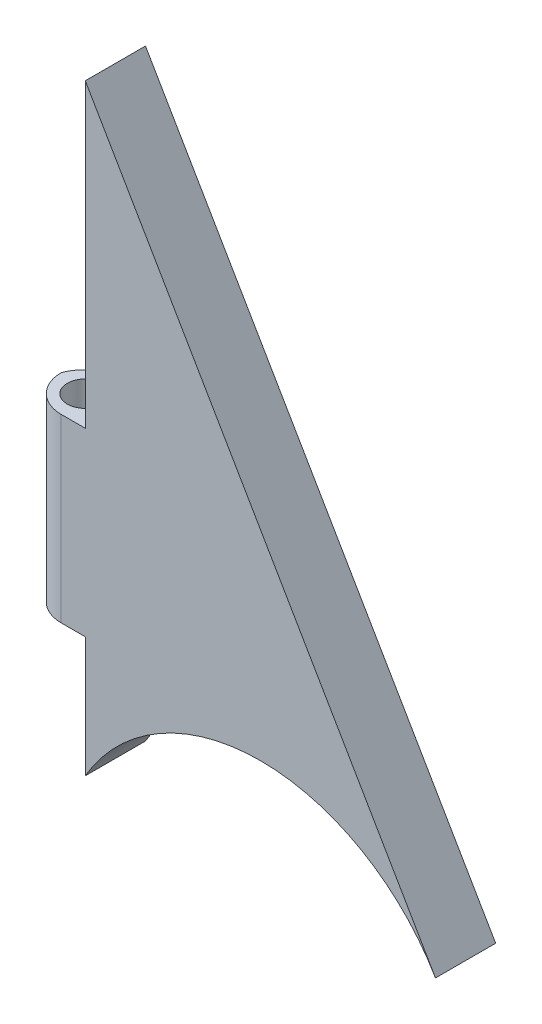
ISO-10303-21;
HEADER;
FILE_DESCRIPTION(('STEP AP214'),'2;1');
FILE_NAME('part.step','',(''),(''),'','','');
FILE_SCHEMA(('AUTOMOTIVE_DESIGN { 1 0 10303 214 1 1 1 1 }'));
ENDSEC;
DATA;
#1=APPLICATION_CONTEXT('core data for automotive mechanical design processes');
#2=APPLICATION_PROTOCOL_DEFINITION('international standard','automotive_design',2000,#1);
#3=PRODUCT_CONTEXT('',#1,'mechanical');
#4=PRODUCT('Part','Part','',(#3));
#5=PRODUCT_RELATED_PRODUCT_CATEGORY('part','',(#4));
#6=PRODUCT_DEFINITION_FORMATION('','',#4);
#7=PRODUCT_DEFINITION_CONTEXT('part definition',#1,'design');
#8=PRODUCT_DEFINITION('design','',#6,#7);
#9=PRODUCT_DEFINITION_SHAPE('','',#8);
#10=(LENGTH_UNIT() NAMED_UNIT(*) SI_UNIT(.MILLI.,.METRE.));
#11=(NAMED_UNIT(*) PLANE_ANGLE_UNIT() SI_UNIT($,.RADIAN.));
#12=(NAMED_UNIT(*) SI_UNIT($,.STERADIAN.) SOLID_ANGLE_UNIT());
#13=UNCERTAINTY_MEASURE_WITH_UNIT(LENGTH_MEASURE(1.E-05),#10,'distance_accuracy_value','');
#14=(GEOMETRIC_REPRESENTATION_CONTEXT(3) GLOBAL_UNCERTAINTY_ASSIGNED_CONTEXT((#13)) GLOBAL_UNIT_ASSIGNED_CONTEXT((#10,
#11,#12)) REPRESENTATION_CONTEXT('',''));
#15=CARTESIAN_POINT('',(0.,0.,0.));
#16=DIRECTION('',(0.,0.,1.));
#17=DIRECTION('',(1.,0.,0.));
#18=AXIS2_PLACEMENT_3D('',#15,#16,#17);
#19=CARTESIAN_POINT('',(0.,0.,-5.));
#20=DIRECTION('',(-1.,0.,0.));
#21=DIRECTION('',(0.,0.,-1.));
#22=AXIS2_PLACEMENT_3D('',#19,#20,#21);
#23=PLANE('',#22);
#24=DIRECTION('',(0.,1.,0.));
#25=VECTOR('',#24,1.);
#26=CARTESIAN_POINT('',(0.,0.,-5.));
#27=LINE('',#26,#25);
#28=CARTESIAN_POINT('',(0.,0.,-5.));
#29=VERTEX_POINT('',#28);
#30=CARTESIAN_POINT('',(0.,10.,-5.));
#31=VERTEX_POINT('',#30);
#32=EDGE_CURVE('E143',#29,#31,#27,.T.);
#33=ORIENTED_EDGE('',*,*,#32,.F.);
#34=DIRECTION('',(0.,0.,1.));
#35=VECTOR('',#34,1.);
#36=CARTESIAN_POINT('',(0.,0.,-5.));
#37=LINE('',#36,#35);
#38=CARTESIAN_POINT('',(0.,0.,0.));
#39=VERTEX_POINT('',#38);
#40=EDGE_CURVE('E148',#29,#39,#37,.T.);
#41=ORIENTED_EDGE('',*,*,#40,.T.);
#42=DIRECTION('',(0.,1.,0.));
#43=VECTOR('',#42,1.);
#44=CARTESIAN_POINT('',(0.,0.,0.));
#45=LINE('',#44,#43);
#46=CARTESIAN_POINT('',(0.,10.,0.));
#47=VERTEX_POINT('',#46);
#48=EDGE_CURVE('E120',#39,#47,#45,.T.);
#49=ORIENTED_EDGE('',*,*,#48,.T.);
#50=DIRECTION('',(0.,0.,1.));
#51=VECTOR('',#50,1.);
#52=CARTESIAN_POINT('',(0.,10.,0.));
#53=LINE('',#52,#51);
#54=EDGE_CURVE('E135',#31,#47,#53,.T.);
#55=ORIENTED_EDGE('',*,*,#54,.F.);
#56=EDGE_LOOP('',(#33,#41,#49,#55));
#57=FACE_BOUND('',#56,.T.);
#58=ADVANCED_FACE('F35',(#57),#23,.T.);
#59=CARTESIAN_POINT('',(14.5441389290883,-8.46127908754482,-5.));
#60=DIRECTION('',(0.,0.,1.));
#61=DIRECTION('',(-1.,0.,0.));
#62=AXIS2_PLACEMENT_3D('',#59,#60,#61);
#63=CYLINDRICAL_SURFACE('',#62,16.8263252371379);
#64=CARTESIAN_POINT('',(14.5441389290883,-8.46127908754482,0.));
#65=DIRECTION('',(0.,0.,1.));
#66=DIRECTION('',(1.,0.,0.));
#67=AXIS2_PLACEMENT_3D('',#64,#65,#66);
#68=CIRCLE('',#67,16.8263252371379);
#69=CARTESIAN_POINT('',(29.0882778581765,0.,0.));
#70=VERTEX_POINT('',#69);
#71=EDGE_CURVE('E121',#70,#39,#68,.T.);
#72=ORIENTED_EDGE('',*,*,#71,.T.);
#73=ORIENTED_EDGE('',*,*,#40,.F.);
#74=CARTESIAN_POINT('',(14.5441389290883,-8.46127908754482,-5.));
#75=DIRECTION('',(0.,0.,1.));
#76=DIRECTION('',(1.,0.,0.));
#77=AXIS2_PLACEMENT_3D('',#74,#75,#76);
#78=CIRCLE('',#77,16.8263252371379);
#79=CARTESIAN_POINT('',(29.0882778581765,0.,-5.));
#80=VERTEX_POINT('',#79);
#81=EDGE_CURVE('E141',#80,#29,#78,.T.);
#82=ORIENTED_EDGE('',*,*,#81,.F.);
#83=DIRECTION('',(0.,0.,1.));
#84=VECTOR('',#83,1.);
#85=CARTESIAN_POINT('',(29.0882778581765,0.,-5.));
#86=LINE('',#85,#84);
#87=EDGE_CURVE('E152',#80,#70,#86,.T.);
#88=ORIENTED_EDGE('',*,*,#87,.T.);
#89=EDGE_LOOP('',(#72,#73,#82,#88));
#90=FACE_BOUND('',#89,.T.);
#91=ADVANCED_FACE('F179',(#90),#63,.F.);
#92=CARTESIAN_POINT('',(0.,50.,-5.));
#93=DIRECTION('',(0.864368109145272,0.502859594611286,0.));
#94=DIRECTION('',(-0.502859594611286,0.864368109145272,0.));
#95=AXIS2_PLACEMENT_3D('',#92,#93,#94);
#96=PLANE('',#95);
#97=DIRECTION('',(0.502859594611286,-0.864368109145272,0.));
#98=VECTOR('',#97,1.);
#99=CARTESIAN_POINT('',(0.,50.,0.));
#100=LINE('',#99,#98);
#101=CARTESIAN_POINT('',(0.,50.,0.));
#102=VERTEX_POINT('',#101);
#103=EDGE_CURVE('E116',#102,#70,#100,.T.);
#104=ORIENTED_EDGE('',*,*,#103,.T.);
#105=ORIENTED_EDGE('',*,*,#87,.F.);
#106=DIRECTION('',(0.502859594611286,-0.864368109145272,0.));
#107=VECTOR('',#106,1.);
#108=CARTESIAN_POINT('',(0.,50.,-5.));
#109=LINE('',#108,#107);
#110=CARTESIAN_POINT('',(0.,50.,-5.));
#111=VERTEX_POINT('',#110);
#112=EDGE_CURVE('E146',#111,#80,#109,.T.);
#113=ORIENTED_EDGE('',*,*,#112,.F.);
#114=DIRECTION('',(0.,0.,1.));
#115=VECTOR('',#114,1.);
#116=CARTESIAN_POINT('',(0.,50.,-5.));
#117=LINE('',#116,#115);
#118=EDGE_CURVE('E156',#111,#102,#117,.T.);
#119=ORIENTED_EDGE('',*,*,#118,.T.);
#120=EDGE_LOOP('',(#104,#105,#113,#119));
#121=FACE_BOUND('',#120,.T.);
#122=ADVANCED_FACE('F183',(#121),#96,.T.);
#123=DIRECTION('',(0.,0.,1.));
#124=VECTOR('',#123,1.);
#125=CARTESIAN_POINT('',(0.,25.,0.));
#126=LINE('',#125,#124);
#127=CARTESIAN_POINT('',(0.,25.,-5.));
#128=VERTEX_POINT('',#127);
#129=CARTESIAN_POINT('',(0.,25.,0.));
#130=VERTEX_POINT('',#129);
#131=EDGE_CURVE('E104',#128,#130,#126,.T.);
#132=ORIENTED_EDGE('',*,*,#131,.T.);
#133=EDGE_CURVE('E113',#130,#102,#45,.T.);
#134=ORIENTED_EDGE('',*,*,#133,.T.);
#135=ORIENTED_EDGE('',*,*,#118,.F.);
#136=EDGE_CURVE('E125',#128,#111,#27,.T.);
#137=ORIENTED_EDGE('',*,*,#136,.F.);
#138=EDGE_LOOP('',(#132,#134,#135,#137));
#139=FACE_BOUND('',#138,.T.);
#140=ADVANCED_FACE('F124',(#139),#23,.T.);
#141=CARTESIAN_POINT('',(14.5441389290883,-8.46127908754482,-5.));
#142=DIRECTION('',(0.,0.,-1.));
#143=DIRECTION('',(1.,0.,0.));
#144=AXIS2_PLACEMENT_3D('',#141,#142,#143);
#145=PLANE('',#144);
#146=DIRECTION('',(1.,0.,0.));
#147=VECTOR('',#146,1.);
#148=CARTESIAN_POINT('',(0.,25.,-5.));
#149=LINE('',#148,#147);
#150=CARTESIAN_POINT('',(-2.17157287525381,25.,-5.));
#151=VERTEX_POINT('',#150);
#152=EDGE_CURVE('E110',#151,#128,#149,.T.);
#153=ORIENTED_EDGE('',*,*,#152,.T.);
#154=ORIENTED_EDGE('',*,*,#136,.T.);
#155=ORIENTED_EDGE('',*,*,#112,.T.);
#156=ORIENTED_EDGE('',*,*,#81,.T.);
#157=ORIENTED_EDGE('',*,*,#32,.T.);
#158=DIRECTION('',(1.,0.,0.));
#159=VECTOR('',#158,1.);
#160=CARTESIAN_POINT('',(0.,10.,-5.));
#161=LINE('',#160,#159);
#162=CARTESIAN_POINT('',(-2.17157287525381,10.,-5.));
#163=VERTEX_POINT('',#162);
#164=EDGE_CURVE('E126',#163,#31,#161,.T.);
#165=ORIENTED_EDGE('',*,*,#164,.F.);
#166=DIRECTION('',(0.,1.,0.));
#167=VECTOR('',#166,1.);
#168=CARTESIAN_POINT('',(-2.17157287525381,10.,-5.));
#169=LINE('',#168,#167);
#170=EDGE_CURVE('E166',#151,#163,#169,.F.);
#171=ORIENTED_EDGE('',*,*,#170,.F.);
#172=EDGE_LOOP('',(#153,#154,#155,#156,#157,#165,#171));
#173=FACE_BOUND('',#172,.T.);
#174=ADVANCED_FACE('F185',(#173),#145,.T.);
#175=CARTESIAN_POINT('',(14.5441389290883,-8.46127908754482,0.));
#176=DIRECTION('',(0.,0.,-1.));
#177=DIRECTION('',(1.,0.,0.));
#178=AXIS2_PLACEMENT_3D('',#175,#176,#177);
#179=PLANE('',#178);
#180=DIRECTION('',(-1.,0.,0.));
#181=VECTOR('',#180,1.);
#182=CARTESIAN_POINT('',(0.,10.,0.));
#183=LINE('',#182,#181);
#184=CARTESIAN_POINT('',(-2.,10.,0.));
#185=VERTEX_POINT('',#184);
#186=EDGE_CURVE('E128',#47,#185,#183,.T.);
#187=ORIENTED_EDGE('',*,*,#186,.F.);
#188=ORIENTED_EDGE('',*,*,#48,.F.);
#189=ORIENTED_EDGE('',*,*,#71,.F.);
#190=ORIENTED_EDGE('',*,*,#103,.F.);
#191=ORIENTED_EDGE('',*,*,#133,.F.);
#192=DIRECTION('',(-1.,0.,0.));
#193=VECTOR('',#192,1.);
#194=CARTESIAN_POINT('',(0.,25.,0.));
#195=LINE('',#194,#193);
#196=CARTESIAN_POINT('',(-2.,25.,0.));
#197=VERTEX_POINT('',#196);
#198=EDGE_CURVE('E98',#130,#197,#195,.T.);
#199=ORIENTED_EDGE('',*,*,#198,.T.);
#200=DIRECTION('',(0.,-1.,0.));
#201=VECTOR('',#200,1.);
#202=CARTESIAN_POINT('',(-2.,-8.46127908754482,0.));
#203=LINE('',#202,#201);
#204=EDGE_CURVE('E163',#185,#197,#203,.F.);
#205=ORIENTED_EDGE('',*,*,#204,.F.);
#206=EDGE_LOOP('',(#187,#188,#189,#190,#191,#199,#205));
#207=FACE_BOUND('',#206,.T.);
#208=ADVANCED_FACE('F114',(#207),#179,.F.);
#209=CARTESIAN_POINT('',(0.,25.,0.));
#210=DIRECTION('',(0.,-1.,0.));
#211=DIRECTION('',(0.,0.,1.));
#212=AXIS2_PLACEMENT_3D('',#209,#210,#211);
#213=PLANE('',#212);
#214=CARTESIAN_POINT('',(-2.,25.,-3.));
#215=DIRECTION('',(0.,1.,0.));
#216=DIRECTION('',(0.,0.,1.));
#217=AXIS2_PLACEMENT_3D('',#214,#215,#216);
#218=CIRCLE('',#217,3.);
#219=CARTESIAN_POINT('',(-5.,25.,-3.));
#220=VERTEX_POINT('',#219);
#221=EDGE_CURVE('E106',#197,#220,#218,.F.);
#222=ORIENTED_EDGE('',*,*,#221,.F.);
#223=ORIENTED_EDGE('',*,*,#198,.F.);
#224=ORIENTED_EDGE('',*,*,#131,.F.);
#225=ORIENTED_EDGE('',*,*,#152,.F.);
#226=CARTESIAN_POINT('',(-2.17157287525381,25.,-2.));
#227=DIRECTION('',(0.,1.,0.));
#228=DIRECTION('',(0.,0.,1.));
#229=AXIS2_PLACEMENT_3D('',#226,#227,#228);
#230=CIRCLE('',#229,3.);
#231=EDGE_CURVE('E11',#220,#151,#230,.F.);
#232=ORIENTED_EDGE('',*,*,#231,.F.);
#233=EDGE_LOOP('',(#222,#223,#224,#225,#232));
#234=FACE_BOUND('',#233,.T.);
#235=CARTESIAN_POINT('',(-2.48600518446587,25.,-2.49117230230951));
#236=DIRECTION('',(0.,-1.,0.));
#237=DIRECTION('',(0.,0.,-1.));
#238=AXIS2_PLACEMENT_3D('',#235,#236,#237);
#239=CIRCLE('',#238,1.5);
#240=CARTESIAN_POINT('',(-2.48600518446587,25.,-3.99117230230951));
#241=VERTEX_POINT('',#240);
#242=EDGE_CURVE('E138',#241,#241,#239,.T.);
#243=ORIENTED_EDGE('',*,*,#242,.T.);
#244=EDGE_LOOP('',(#243));
#245=FACE_BOUND('',#244,.T.);
#246=ADVANCED_FACE('F100',(#234,#245),#213,.F.);
#247=CARTESIAN_POINT('',(0.,10.,0.));
#248=DIRECTION('',(0.,-1.,0.));
#249=DIRECTION('',(0.,0.,1.));
#250=AXIS2_PLACEMENT_3D('',#247,#248,#249);
#251=PLANE('',#250);
#252=ORIENTED_EDGE('',*,*,#164,.T.);
#253=ORIENTED_EDGE('',*,*,#54,.T.);
#254=ORIENTED_EDGE('',*,*,#186,.T.);
#255=CARTESIAN_POINT('',(-2.,10.,-3.));
#256=DIRECTION('',(0.,1.,0.));
#257=DIRECTION('',(0.,0.,1.));
#258=AXIS2_PLACEMENT_3D('',#255,#256,#257);
#259=CIRCLE('',#258,3.);
#260=CARTESIAN_POINT('',(-5.,10.,-3.));
#261=VERTEX_POINT('',#260);
#262=EDGE_CURVE('E161',#261,#185,#259,.T.);
#263=ORIENTED_EDGE('',*,*,#262,.F.);
#264=CARTESIAN_POINT('',(-2.17157287525381,10.,-2.));
#265=DIRECTION('',(0.,1.,0.));
#266=DIRECTION('',(0.,0.,1.));
#267=AXIS2_PLACEMENT_3D('',#264,#265,#266);
#268=CIRCLE('',#267,3.);
#269=EDGE_CURVE('E43',#163,#261,#268,.T.);
#270=ORIENTED_EDGE('',*,*,#269,.F.);
#271=EDGE_LOOP('',(#252,#253,#254,#263,#270));
#272=FACE_BOUND('',#271,.T.);
#273=CARTESIAN_POINT('',(-2.48600518446587,10.,-2.49117230230951));
#274=DIRECTION('',(0.,-1.,0.));
#275=DIRECTION('',(0.,0.,-1.));
#276=AXIS2_PLACEMENT_3D('',#273,#274,#275);
#277=CIRCLE('',#276,1.5);
#278=CARTESIAN_POINT('',(-2.48600518446587,10.,-3.99117230230951));
#279=VERTEX_POINT('',#278);
#280=EDGE_CURVE('E131',#279,#279,#277,.T.);
#281=ORIENTED_EDGE('',*,*,#280,.F.);
#282=EDGE_LOOP('',(#281));
#283=FACE_BOUND('',#282,.T.);
#284=ADVANCED_FACE('F168',(#272,#283),#251,.T.);
#285=CARTESIAN_POINT('',(-2.48600518446587,25.,-2.49117230230951));
#286=DIRECTION('',(0.,-1.,0.));
#287=DIRECTION('',(0.,0.,1.));
#288=AXIS2_PLACEMENT_3D('',#285,#286,#287);
#289=CYLINDRICAL_SURFACE('',#288,1.5);
#290=ORIENTED_EDGE('',*,*,#242,.F.);
#291=EDGE_LOOP('',(#290));
#292=FACE_BOUND('',#291,.T.);
#293=ORIENTED_EDGE('',*,*,#280,.T.);
#294=EDGE_LOOP('',(#293));
#295=FACE_BOUND('',#294,.T.);
#296=ADVANCED_FACE('F202',(#292,#295),#289,.F.);
#297=CARTESIAN_POINT('',(-2.,25.,-3.));
#298=DIRECTION('',(0.,-1.,0.));
#299=DIRECTION('',(0.,0.,1.));
#300=AXIS2_PLACEMENT_3D('',#297,#298,#299);
#301=CYLINDRICAL_SURFACE('',#300,3.);
#302=ORIENTED_EDGE('',*,*,#221,.T.);
#303=DIRECTION('',(0.,-1.,0.));
#304=VECTOR('',#303,1.);
#305=CARTESIAN_POINT('',(-5.,25.,-3.));
#306=LINE('',#305,#304);
#307=EDGE_CURVE('E155',#220,#261,#306,.T.);
#308=ORIENTED_EDGE('',*,*,#307,.T.);
#309=ORIENTED_EDGE('',*,*,#262,.T.);
#310=ORIENTED_EDGE('',*,*,#204,.T.);
#311=EDGE_LOOP('',(#302,#308,#309,#310));
#312=FACE_BOUND('',#311,.T.);
#313=ADVANCED_FACE('F171',(#312),#301,.T.);
#314=CARTESIAN_POINT('',(-2.17157287525381,25.,-2.));
#315=DIRECTION('',(0.,-1.,0.));
#316=DIRECTION('',(0.,0.,1.));
#317=AXIS2_PLACEMENT_3D('',#314,#315,#316);
#318=CYLINDRICAL_SURFACE('',#317,3.);
#319=ORIENTED_EDGE('',*,*,#231,.T.);
#320=ORIENTED_EDGE('',*,*,#170,.T.);
#321=ORIENTED_EDGE('',*,*,#269,.T.);
#322=ORIENTED_EDGE('',*,*,#307,.F.);
#323=EDGE_LOOP('',(#319,#320,#321,#322));
#324=FACE_BOUND('',#323,.T.);
#325=ADVANCED_FACE('F37',(#324),#318,.T.);
#326=CLOSED_SHELL('',(#58,#91,#122,#140,#174,#208,#246,#284,#296,#313,#325));
#327=MANIFOLD_SOLID_BREP('B2',#326);
#328=ADVANCED_BREP_SHAPE_REPRESENTATION('',(#18,#327),#14);
#329=SHAPE_DEFINITION_REPRESENTATION(#9,#328);
ENDSEC;
END-ISO-10303-21;
